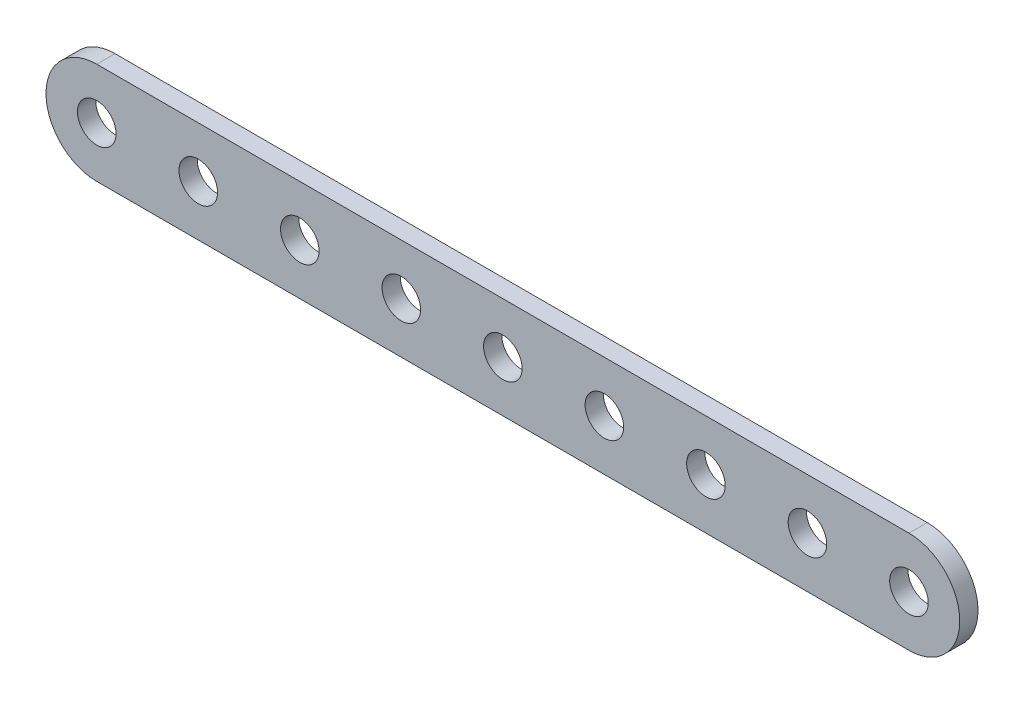
ISO-10303-21;
HEADER;
FILE_DESCRIPTION(('STEP AP214'),'2;1');
FILE_NAME('part.step','',(''),(''),'','','');
FILE_SCHEMA(('AUTOMOTIVE_DESIGN { 1 0 10303 214 1 1 1 1 }'));
ENDSEC;
DATA;
#1=APPLICATION_CONTEXT('core data for automotive mechanical design processes');
#2=APPLICATION_PROTOCOL_DEFINITION('international standard','automotive_design',2000,#1);
#3=PRODUCT_CONTEXT('',#1,'mechanical');
#4=PRODUCT('Part','Part','',(#3));
#5=PRODUCT_RELATED_PRODUCT_CATEGORY('part','',(#4));
#6=PRODUCT_DEFINITION_FORMATION('','',#4);
#7=PRODUCT_DEFINITION_CONTEXT('part definition',#1,'design');
#8=PRODUCT_DEFINITION('design','',#6,#7);
#9=PRODUCT_DEFINITION_SHAPE('','',#8);
#10=(LENGTH_UNIT() NAMED_UNIT(*) SI_UNIT(.MILLI.,.METRE.));
#11=(NAMED_UNIT(*) PLANE_ANGLE_UNIT() SI_UNIT($,.RADIAN.));
#12=(NAMED_UNIT(*) SI_UNIT($,.STERADIAN.) SOLID_ANGLE_UNIT());
#13=UNCERTAINTY_MEASURE_WITH_UNIT(LENGTH_MEASURE(1.E-05),#10,'distance_accuracy_value','');
#14=(GEOMETRIC_REPRESENTATION_CONTEXT(3) GLOBAL_UNCERTAINTY_ASSIGNED_CONTEXT((#13)) GLOBAL_UNIT_ASSIGNED_CONTEXT((#10,
#11,#12)) REPRESENTATION_CONTEXT('',''));
#15=CARTESIAN_POINT('',(0.,0.,0.));
#16=DIRECTION('',(0.,0.,1.));
#17=DIRECTION('',(1.,0.,0.));
#18=AXIS2_PLACEMENT_3D('',#15,#16,#17);
#19=CARTESIAN_POINT('',(-50.8,0.,2.286));
#20=DIRECTION('',(0.,0.,-1.));
#21=DIRECTION('',(-1.,0.,0.));
#22=AXIS2_PLACEMENT_3D('',#19,#20,#21);
#23=CYLINDRICAL_SURFACE('',#22,6.35000000000002);
#24=CARTESIAN_POINT('',(-50.8,0.,0.));
#25=DIRECTION('',(0.,0.,1.));
#26=DIRECTION('',(1.,0.,0.));
#27=AXIS2_PLACEMENT_3D('',#24,#25,#26);
#28=CIRCLE('',#27,6.35000000000002);
#29=CARTESIAN_POINT('',(-50.8,6.35000000000002,0.));
#30=VERTEX_POINT('',#29);
#31=CARTESIAN_POINT('',(-50.8,-6.35000000000002,0.));
#32=VERTEX_POINT('',#31);
#33=EDGE_CURVE('E100',#30,#32,#28,.T.);
#34=ORIENTED_EDGE('',*,*,#33,.T.);
#35=DIRECTION('',(0.,0.,-1.));
#36=VECTOR('',#35,1.);
#37=CARTESIAN_POINT('',(-50.8,-6.35000000000002,2.286));
#38=LINE('',#37,#36);
#39=CARTESIAN_POINT('',(-50.8,-6.35000000000002,2.286));
#40=VERTEX_POINT('',#39);
#41=EDGE_CURVE('E11',#40,#32,#38,.T.);
#42=ORIENTED_EDGE('',*,*,#41,.F.);
#43=CARTESIAN_POINT('',(-50.8,0.,2.286));
#44=DIRECTION('',(0.,0.,1.));
#45=DIRECTION('',(1.,0.,0.));
#46=AXIS2_PLACEMENT_3D('',#43,#44,#45);
#47=CIRCLE('',#46,6.35000000000002);
#48=CARTESIAN_POINT('',(-50.8,6.35000000000002,2.286));
#49=VERTEX_POINT('',#48);
#50=EDGE_CURVE('E88',#49,#40,#47,.T.);
#51=ORIENTED_EDGE('',*,*,#50,.F.);
#52=DIRECTION('',(0.,0.,-1.));
#53=VECTOR('',#52,1.);
#54=CARTESIAN_POINT('',(-50.8,6.35000000000002,2.286));
#55=LINE('',#54,#53);
#56=EDGE_CURVE('E96',#49,#30,#55,.T.);
#57=ORIENTED_EDGE('',*,*,#56,.T.);
#58=EDGE_LOOP('',(#34,#42,#51,#57));
#59=FACE_BOUND('',#58,.T.);
#60=ADVANCED_FACE('F37',(#59),#23,.T.);
#61=CARTESIAN_POINT('',(-50.8,-6.35000000000002,2.286));
#62=DIRECTION('',(0.,1.,0.));
#63=DIRECTION('',(-1.,0.,0.));
#64=AXIS2_PLACEMENT_3D('',#61,#62,#63);
#65=PLANE('',#64);
#66=DIRECTION('',(1.,0.,0.));
#67=VECTOR('',#66,1.);
#68=CARTESIAN_POINT('',(-50.8,-6.35000000000002,0.));
#69=LINE('',#68,#67);
#70=CARTESIAN_POINT('',(50.8,-6.35000000000002,0.));
#71=VERTEX_POINT('',#70);
#72=EDGE_CURVE('E92',#32,#71,#69,.T.);
#73=ORIENTED_EDGE('',*,*,#72,.T.);
#74=DIRECTION('',(0.,0.,-1.));
#75=VECTOR('',#74,1.);
#76=CARTESIAN_POINT('',(50.8,-6.35000000000002,2.286));
#77=LINE('',#76,#75);
#78=CARTESIAN_POINT('',(50.8,-6.35000000000002,2.286));
#79=VERTEX_POINT('',#78);
#80=EDGE_CURVE('E45',#79,#71,#77,.T.);
#81=ORIENTED_EDGE('',*,*,#80,.F.);
#82=DIRECTION('',(1.,0.,0.));
#83=VECTOR('',#82,1.);
#84=CARTESIAN_POINT('',(-50.8,-6.35000000000002,2.286));
#85=LINE('',#84,#83);
#86=EDGE_CURVE('E83',#40,#79,#85,.T.);
#87=ORIENTED_EDGE('',*,*,#86,.F.);
#88=ORIENTED_EDGE('',*,*,#41,.T.);
#89=EDGE_LOOP('',(#73,#81,#87,#88));
#90=FACE_BOUND('',#89,.T.);
#91=ADVANCED_FACE('F91',(#90),#65,.F.);
#92=CARTESIAN_POINT('',(50.8,0.,2.286));
#93=DIRECTION('',(0.,0.,-1.));
#94=DIRECTION('',(-1.,0.,0.));
#95=AXIS2_PLACEMENT_3D('',#92,#93,#94);
#96=CYLINDRICAL_SURFACE('',#95,6.35000000000002);
#97=CARTESIAN_POINT('',(50.8,0.,0.));
#98=DIRECTION('',(0.,0.,1.));
#99=DIRECTION('',(1.,0.,0.));
#100=AXIS2_PLACEMENT_3D('',#97,#98,#99);
#101=CIRCLE('',#100,6.35000000000002);
#102=CARTESIAN_POINT('',(50.8,6.35000000000004,0.));
#103=VERTEX_POINT('',#102);
#104=EDGE_CURVE('E70',#71,#103,#101,.T.);
#105=ORIENTED_EDGE('',*,*,#104,.T.);
#106=DIRECTION('',(0.,0.,-1.));
#107=VECTOR('',#106,1.);
#108=CARTESIAN_POINT('',(50.8,6.35000000000004,2.286));
#109=LINE('',#108,#107);
#110=CARTESIAN_POINT('',(50.8,6.35000000000004,2.286));
#111=VERTEX_POINT('',#110);
#112=EDGE_CURVE('E93',#111,#103,#109,.T.);
#113=ORIENTED_EDGE('',*,*,#112,.F.);
#114=CARTESIAN_POINT('',(50.8,0.,2.286));
#115=DIRECTION('',(0.,0.,1.));
#116=DIRECTION('',(1.,0.,0.));
#117=AXIS2_PLACEMENT_3D('',#114,#115,#116);
#118=CIRCLE('',#117,6.35000000000002);
#119=EDGE_CURVE('E86',#79,#111,#118,.T.);
#120=ORIENTED_EDGE('',*,*,#119,.F.);
#121=ORIENTED_EDGE('',*,*,#80,.T.);
#122=EDGE_LOOP('',(#105,#113,#120,#121));
#123=FACE_BOUND('',#122,.T.);
#124=ADVANCED_FACE('F94',(#123),#96,.T.);
#125=CARTESIAN_POINT('',(-50.8,6.35000000000002,2.286));
#126=DIRECTION('',(0.,-1.,0.));
#127=DIRECTION('',(1.,0.,0.));
#128=AXIS2_PLACEMENT_3D('',#125,#126,#127);
#129=PLANE('',#128);
#130=DIRECTION('',(-1.,0.,0.));
#131=VECTOR('',#130,1.);
#132=CARTESIAN_POINT('',(-50.8,6.35000000000002,0.));
#133=LINE('',#132,#131);
#134=EDGE_CURVE('E76',#103,#30,#133,.T.);
#135=ORIENTED_EDGE('',*,*,#134,.T.);
#136=ORIENTED_EDGE('',*,*,#56,.F.);
#137=DIRECTION('',(-1.,0.,0.));
#138=VECTOR('',#137,1.);
#139=CARTESIAN_POINT('',(-50.8,6.35000000000002,2.286));
#140=LINE('',#139,#138);
#141=EDGE_CURVE('E53',#111,#49,#140,.T.);
#142=ORIENTED_EDGE('',*,*,#141,.F.);
#143=ORIENTED_EDGE('',*,*,#112,.T.);
#144=EDGE_LOOP('',(#135,#136,#142,#143));
#145=FACE_BOUND('',#144,.T.);
#146=ADVANCED_FACE('F108',(#145),#129,.F.);
#147=CARTESIAN_POINT('',(-50.8,0.,2.286));
#148=DIRECTION('',(0.,0.,1.));
#149=DIRECTION('',(1.,0.,0.));
#150=AXIS2_PLACEMENT_3D('',#147,#148,#149);
#151=PLANE('',#150);
#152=CARTESIAN_POINT('',(-25.4,0.,2.286));
#153=DIRECTION('',(0.,0.,1.));
#154=DIRECTION('',(1.,0.,0.));
#155=AXIS2_PLACEMENT_3D('',#152,#153,#154);
#156=CIRCLE('',#155,2.413);
#157=CARTESIAN_POINT('',(-22.987,0.,2.286));
#158=VERTEX_POINT('',#157);
#159=EDGE_CURVE('E125',#158,#158,#156,.T.);
#160=ORIENTED_EDGE('',*,*,#159,.F.);
#161=EDGE_LOOP('',(#160));
#162=FACE_BOUND('',#161,.T.);
#163=CARTESIAN_POINT('',(-12.7,0.,2.286));
#164=DIRECTION('',(0.,0.,1.));
#165=DIRECTION('',(1.,0.,0.));
#166=AXIS2_PLACEMENT_3D('',#163,#164,#165);
#167=CIRCLE('',#166,2.413);
#168=CARTESIAN_POINT('',(-10.287,0.,2.286));
#169=VERTEX_POINT('',#168);
#170=EDGE_CURVE('E157',#169,#169,#167,.T.);
#171=ORIENTED_EDGE('',*,*,#170,.F.);
#172=EDGE_LOOP('',(#171));
#173=FACE_BOUND('',#172,.T.);
#174=CARTESIAN_POINT('',(0.,0.,2.286));
#175=DIRECTION('',(0.,0.,1.));
#176=DIRECTION('',(1.,0.,0.));
#177=AXIS2_PLACEMENT_3D('',#174,#175,#176);
#178=CIRCLE('',#177,2.413);
#179=CARTESIAN_POINT('',(2.41300000000001,0.,2.286));
#180=VERTEX_POINT('',#179);
#181=EDGE_CURVE('E151',#180,#180,#178,.T.);
#182=ORIENTED_EDGE('',*,*,#181,.F.);
#183=EDGE_LOOP('',(#182));
#184=FACE_BOUND('',#183,.T.);
#185=CARTESIAN_POINT('',(12.7,0.,2.286));
#186=DIRECTION('',(0.,0.,1.));
#187=DIRECTION('',(1.,0.,0.));
#188=AXIS2_PLACEMENT_3D('',#185,#186,#187);
#189=CIRCLE('',#188,2.413);
#190=CARTESIAN_POINT('',(15.113,0.,2.286));
#191=VERTEX_POINT('',#190);
#192=EDGE_CURVE('E145',#191,#191,#189,.T.);
#193=ORIENTED_EDGE('',*,*,#192,.F.);
#194=EDGE_LOOP('',(#193));
#195=FACE_BOUND('',#194,.T.);
#196=CARTESIAN_POINT('',(25.4,0.,2.286));
#197=DIRECTION('',(0.,0.,1.));
#198=DIRECTION('',(1.,0.,0.));
#199=AXIS2_PLACEMENT_3D('',#196,#197,#198);
#200=CIRCLE('',#199,2.413);
#201=CARTESIAN_POINT('',(27.813,0.,2.286));
#202=VERTEX_POINT('',#201);
#203=EDGE_CURVE('E139',#202,#202,#200,.T.);
#204=ORIENTED_EDGE('',*,*,#203,.F.);
#205=EDGE_LOOP('',(#204));
#206=FACE_BOUND('',#205,.T.);
#207=CARTESIAN_POINT('',(38.1,0.,2.286));
#208=DIRECTION('',(0.,0.,1.));
#209=DIRECTION('',(1.,0.,0.));
#210=AXIS2_PLACEMENT_3D('',#207,#208,#209);
#211=CIRCLE('',#210,2.413);
#212=CARTESIAN_POINT('',(40.513,0.,2.286));
#213=VERTEX_POINT('',#212);
#214=EDGE_CURVE('E133',#213,#213,#211,.T.);
#215=ORIENTED_EDGE('',*,*,#214,.F.);
#216=EDGE_LOOP('',(#215));
#217=FACE_BOUND('',#216,.T.);
#218=CARTESIAN_POINT('',(50.8,0.,2.286));
#219=DIRECTION('',(0.,0.,1.));
#220=DIRECTION('',(1.,0.,0.));
#221=AXIS2_PLACEMENT_3D('',#218,#219,#220);
#222=CIRCLE('',#221,2.413);
#223=CARTESIAN_POINT('',(53.213,0.,2.286));
#224=VERTEX_POINT('',#223);
#225=EDGE_CURVE('E126',#224,#224,#222,.T.);
#226=ORIENTED_EDGE('',*,*,#225,.F.);
#227=EDGE_LOOP('',(#226));
#228=FACE_BOUND('',#227,.T.);
#229=CARTESIAN_POINT('',(-38.1,0.,2.286));
#230=DIRECTION('',(0.,0.,1.));
#231=DIRECTION('',(1.,0.,0.));
#232=AXIS2_PLACEMENT_3D('',#229,#230,#231);
#233=CIRCLE('',#232,2.413);
#234=CARTESIAN_POINT('',(-35.687,0.,2.286));
#235=VERTEX_POINT('',#234);
#236=EDGE_CURVE('E117',#235,#235,#233,.T.);
#237=ORIENTED_EDGE('',*,*,#236,.F.);
#238=EDGE_LOOP('',(#237));
#239=FACE_BOUND('',#238,.T.);
#240=CARTESIAN_POINT('',(-50.8,0.,2.286));
#241=DIRECTION('',(0.,0.,1.));
#242=DIRECTION('',(1.,0.,0.));
#243=AXIS2_PLACEMENT_3D('',#240,#241,#242);
#244=CIRCLE('',#243,2.413);
#245=CARTESIAN_POINT('',(-48.387,0.,2.286));
#246=VERTEX_POINT('',#245);
#247=EDGE_CURVE('E114',#246,#246,#244,.T.);
#248=ORIENTED_EDGE('',*,*,#247,.F.);
#249=EDGE_LOOP('',(#248));
#250=FACE_BOUND('',#249,.T.);
#251=ORIENTED_EDGE('',*,*,#50,.T.);
#252=ORIENTED_EDGE('',*,*,#86,.T.);
#253=ORIENTED_EDGE('',*,*,#119,.T.);
#254=ORIENTED_EDGE('',*,*,#141,.T.);
#255=EDGE_LOOP('',(#251,#252,#253,#254));
#256=FACE_BOUND('',#255,.T.);
#257=ADVANCED_FACE('F84',(#162,#173,#184,#195,#206,#217,#228,#239,#250,#256),#151,.T.);
#258=CARTESIAN_POINT('',(-50.8,0.,0.));
#259=DIRECTION('',(0.,0.,1.));
#260=DIRECTION('',(1.,0.,0.));
#261=AXIS2_PLACEMENT_3D('',#258,#259,#260);
#262=PLANE('',#261);
#263=CARTESIAN_POINT('',(-25.4,0.,0.));
#264=DIRECTION('',(0.,0.,1.));
#265=DIRECTION('',(1.,0.,0.));
#266=AXIS2_PLACEMENT_3D('',#263,#264,#265);
#267=CIRCLE('',#266,2.413);
#268=CARTESIAN_POINT('',(-22.987,0.,0.));
#269=VERTEX_POINT('',#268);
#270=EDGE_CURVE('E160',#269,#269,#267,.T.);
#271=ORIENTED_EDGE('',*,*,#270,.T.);
#272=EDGE_LOOP('',(#271));
#273=FACE_BOUND('',#272,.T.);
#274=CARTESIAN_POINT('',(-12.7,0.,0.));
#275=DIRECTION('',(0.,0.,1.));
#276=DIRECTION('',(1.,0.,0.));
#277=AXIS2_PLACEMENT_3D('',#274,#275,#276);
#278=CIRCLE('',#277,2.413);
#279=CARTESIAN_POINT('',(-10.287,0.,0.));
#280=VERTEX_POINT('',#279);
#281=EDGE_CURVE('E154',#280,#280,#278,.T.);
#282=ORIENTED_EDGE('',*,*,#281,.T.);
#283=EDGE_LOOP('',(#282));
#284=FACE_BOUND('',#283,.T.);
#285=CARTESIAN_POINT('',(0.,0.,0.));
#286=DIRECTION('',(0.,0.,1.));
#287=DIRECTION('',(1.,0.,0.));
#288=AXIS2_PLACEMENT_3D('',#285,#286,#287);
#289=CIRCLE('',#288,2.413);
#290=CARTESIAN_POINT('',(2.41300000000001,0.,0.));
#291=VERTEX_POINT('',#290);
#292=EDGE_CURVE('E148',#291,#291,#289,.T.);
#293=ORIENTED_EDGE('',*,*,#292,.T.);
#294=EDGE_LOOP('',(#293));
#295=FACE_BOUND('',#294,.T.);
#296=CARTESIAN_POINT('',(12.7,0.,0.));
#297=DIRECTION('',(0.,0.,1.));
#298=DIRECTION('',(1.,0.,0.));
#299=AXIS2_PLACEMENT_3D('',#296,#297,#298);
#300=CIRCLE('',#299,2.413);
#301=CARTESIAN_POINT('',(15.113,0.,0.));
#302=VERTEX_POINT('',#301);
#303=EDGE_CURVE('E142',#302,#302,#300,.T.);
#304=ORIENTED_EDGE('',*,*,#303,.T.);
#305=EDGE_LOOP('',(#304));
#306=FACE_BOUND('',#305,.T.);
#307=CARTESIAN_POINT('',(25.4,0.,0.));
#308=DIRECTION('',(0.,0.,1.));
#309=DIRECTION('',(1.,0.,0.));
#310=AXIS2_PLACEMENT_3D('',#307,#308,#309);
#311=CIRCLE('',#310,2.413);
#312=CARTESIAN_POINT('',(27.813,0.,0.));
#313=VERTEX_POINT('',#312);
#314=EDGE_CURVE('E136',#313,#313,#311,.T.);
#315=ORIENTED_EDGE('',*,*,#314,.T.);
#316=EDGE_LOOP('',(#315));
#317=FACE_BOUND('',#316,.T.);
#318=CARTESIAN_POINT('',(38.1,0.,0.));
#319=DIRECTION('',(0.,0.,1.));
#320=DIRECTION('',(1.,0.,0.));
#321=AXIS2_PLACEMENT_3D('',#318,#319,#320);
#322=CIRCLE('',#321,2.413);
#323=CARTESIAN_POINT('',(40.513,0.,0.));
#324=VERTEX_POINT('',#323);
#325=EDGE_CURVE('E129',#324,#324,#322,.T.);
#326=ORIENTED_EDGE('',*,*,#325,.T.);
#327=EDGE_LOOP('',(#326));
#328=FACE_BOUND('',#327,.T.);
#329=CARTESIAN_POINT('',(50.8,0.,0.));
#330=DIRECTION('',(0.,0.,1.));
#331=DIRECTION('',(1.,0.,0.));
#332=AXIS2_PLACEMENT_3D('',#329,#330,#331);
#333=CIRCLE('',#332,2.413);
#334=CARTESIAN_POINT('',(53.213,0.,0.));
#335=VERTEX_POINT('',#334);
#336=EDGE_CURVE('E130',#335,#335,#333,.T.);
#337=ORIENTED_EDGE('',*,*,#336,.T.);
#338=EDGE_LOOP('',(#337));
#339=FACE_BOUND('',#338,.T.);
#340=CARTESIAN_POINT('',(-38.1,0.,0.));
#341=DIRECTION('',(0.,0.,1.));
#342=DIRECTION('',(1.,0.,0.));
#343=AXIS2_PLACEMENT_3D('',#340,#341,#342);
#344=CIRCLE('',#343,2.413);
#345=CARTESIAN_POINT('',(-35.687,0.,0.));
#346=VERTEX_POINT('',#345);
#347=EDGE_CURVE('E122',#346,#346,#344,.T.);
#348=ORIENTED_EDGE('',*,*,#347,.T.);
#349=EDGE_LOOP('',(#348));
#350=FACE_BOUND('',#349,.T.);
#351=CARTESIAN_POINT('',(-50.8,0.,0.));
#352=DIRECTION('',(0.,0.,1.));
#353=DIRECTION('',(1.,0.,0.));
#354=AXIS2_PLACEMENT_3D('',#351,#352,#353);
#355=CIRCLE('',#354,2.413);
#356=CARTESIAN_POINT('',(-48.387,0.,0.));
#357=VERTEX_POINT('',#356);
#358=EDGE_CURVE('E103',#357,#357,#355,.T.);
#359=ORIENTED_EDGE('',*,*,#358,.T.);
#360=EDGE_LOOP('',(#359));
#361=FACE_BOUND('',#360,.T.);
#362=ORIENTED_EDGE('',*,*,#33,.F.);
#363=ORIENTED_EDGE('',*,*,#134,.F.);
#364=ORIENTED_EDGE('',*,*,#104,.F.);
#365=ORIENTED_EDGE('',*,*,#72,.F.);
#366=EDGE_LOOP('',(#362,#363,#364,#365));
#367=FACE_BOUND('',#366,.T.);
#368=ADVANCED_FACE('F111',(#273,#284,#295,#306,#317,#328,#339,#350,#361,#367),#262,.F.);
#369=CARTESIAN_POINT('',(-50.8,0.,0.));
#370=DIRECTION('',(0.,0.,1.));
#371=DIRECTION('',(1.,0.,0.));
#372=AXIS2_PLACEMENT_3D('',#369,#370,#371);
#373=CYLINDRICAL_SURFACE('',#372,2.413);
#374=ORIENTED_EDGE('',*,*,#358,.F.);
#375=EDGE_LOOP('',(#374));
#376=FACE_BOUND('',#375,.T.);
#377=ORIENTED_EDGE('',*,*,#247,.T.);
#378=EDGE_LOOP('',(#377));
#379=FACE_BOUND('',#378,.T.);
#380=ADVANCED_FACE('F196',(#376,#379),#373,.F.);
#381=CARTESIAN_POINT('',(-38.1,0.,0.));
#382=DIRECTION('',(0.,0.,1.));
#383=DIRECTION('',(1.,0.,0.));
#384=AXIS2_PLACEMENT_3D('',#381,#382,#383);
#385=CYLINDRICAL_SURFACE('',#384,2.413);
#386=ORIENTED_EDGE('',*,*,#347,.F.);
#387=EDGE_LOOP('',(#386));
#388=FACE_BOUND('',#387,.T.);
#389=ORIENTED_EDGE('',*,*,#236,.T.);
#390=EDGE_LOOP('',(#389));
#391=FACE_BOUND('',#390,.T.);
#392=ADVANCED_FACE('F198',(#388,#391),#385,.F.);
#393=CARTESIAN_POINT('',(50.8,0.,0.));
#394=DIRECTION('',(0.,0.,1.));
#395=DIRECTION('',(1.,0.,0.));
#396=AXIS2_PLACEMENT_3D('',#393,#394,#395);
#397=CYLINDRICAL_SURFACE('',#396,2.413);
#398=ORIENTED_EDGE('',*,*,#336,.F.);
#399=EDGE_LOOP('',(#398));
#400=FACE_BOUND('',#399,.T.);
#401=ORIENTED_EDGE('',*,*,#225,.T.);
#402=EDGE_LOOP('',(#401));
#403=FACE_BOUND('',#402,.T.);
#404=ADVANCED_FACE('F205',(#400,#403),#397,.F.);
#405=CARTESIAN_POINT('',(38.1,0.,0.));
#406=DIRECTION('',(0.,0.,1.));
#407=DIRECTION('',(1.,0.,0.));
#408=AXIS2_PLACEMENT_3D('',#405,#406,#407);
#409=CYLINDRICAL_SURFACE('',#408,2.413);
#410=ORIENTED_EDGE('',*,*,#325,.F.);
#411=EDGE_LOOP('',(#410));
#412=FACE_BOUND('',#411,.T.);
#413=ORIENTED_EDGE('',*,*,#214,.T.);
#414=EDGE_LOOP('',(#413));
#415=FACE_BOUND('',#414,.T.);
#416=ADVANCED_FACE('F248',(#412,#415),#409,.F.);
#417=CARTESIAN_POINT('',(25.4,0.,0.));
#418=DIRECTION('',(0.,0.,1.));
#419=DIRECTION('',(1.,0.,0.));
#420=AXIS2_PLACEMENT_3D('',#417,#418,#419);
#421=CYLINDRICAL_SURFACE('',#420,2.413);
#422=ORIENTED_EDGE('',*,*,#314,.F.);
#423=EDGE_LOOP('',(#422));
#424=FACE_BOUND('',#423,.T.);
#425=ORIENTED_EDGE('',*,*,#203,.T.);
#426=EDGE_LOOP('',(#425));
#427=FACE_BOUND('',#426,.T.);
#428=ADVANCED_FACE('F258',(#424,#427),#421,.F.);
#429=CARTESIAN_POINT('',(12.7,0.,0.));
#430=DIRECTION('',(0.,0.,1.));
#431=DIRECTION('',(1.,0.,0.));
#432=AXIS2_PLACEMENT_3D('',#429,#430,#431);
#433=CYLINDRICAL_SURFACE('',#432,2.413);
#434=ORIENTED_EDGE('',*,*,#303,.F.);
#435=EDGE_LOOP('',(#434));
#436=FACE_BOUND('',#435,.T.);
#437=ORIENTED_EDGE('',*,*,#192,.T.);
#438=EDGE_LOOP('',(#437));
#439=FACE_BOUND('',#438,.T.);
#440=ADVANCED_FACE('F268',(#436,#439),#433,.F.);
#441=CARTESIAN_POINT('',(0.,0.,0.));
#442=DIRECTION('',(0.,0.,1.));
#443=DIRECTION('',(1.,0.,0.));
#444=AXIS2_PLACEMENT_3D('',#441,#442,#443);
#445=CYLINDRICAL_SURFACE('',#444,2.413);
#446=ORIENTED_EDGE('',*,*,#292,.F.);
#447=EDGE_LOOP('',(#446));
#448=FACE_BOUND('',#447,.T.);
#449=ORIENTED_EDGE('',*,*,#181,.T.);
#450=EDGE_LOOP('',(#449));
#451=FACE_BOUND('',#450,.T.);
#452=ADVANCED_FACE('F278',(#448,#451),#445,.F.);
#453=CARTESIAN_POINT('',(-12.7,0.,0.));
#454=DIRECTION('',(0.,0.,1.));
#455=DIRECTION('',(1.,0.,0.));
#456=AXIS2_PLACEMENT_3D('',#453,#454,#455);
#457=CYLINDRICAL_SURFACE('',#456,2.413);
#458=ORIENTED_EDGE('',*,*,#281,.F.);
#459=EDGE_LOOP('',(#458));
#460=FACE_BOUND('',#459,.T.);
#461=ORIENTED_EDGE('',*,*,#170,.T.);
#462=EDGE_LOOP('',(#461));
#463=FACE_BOUND('',#462,.T.);
#464=ADVANCED_FACE('F173',(#460,#463),#457,.F.);
#465=CARTESIAN_POINT('',(-25.4,0.,0.));
#466=DIRECTION('',(0.,0.,1.));
#467=DIRECTION('',(1.,0.,0.));
#468=AXIS2_PLACEMENT_3D('',#465,#466,#467);
#469=CYLINDRICAL_SURFACE('',#468,2.413);
#470=ORIENTED_EDGE('',*,*,#270,.F.);
#471=EDGE_LOOP('',(#470));
#472=FACE_BOUND('',#471,.T.);
#473=ORIENTED_EDGE('',*,*,#159,.T.);
#474=EDGE_LOOP('',(#473));
#475=FACE_BOUND('',#474,.T.);
#476=ADVANCED_FACE('F170',(#472,#475),#469,.F.);
#477=CLOSED_SHELL('',(#60,#91,#124,#146,#257,#368,#380,#392,#404,#416,#428,#440,#452,#464,#476));
#478=MANIFOLD_SOLID_BREP('B2',#477);
#479=ADVANCED_BREP_SHAPE_REPRESENTATION('',(#18,#478),#14);
#480=SHAPE_DEFINITION_REPRESENTATION(#9,#479);
ENDSEC;
END-ISO-10303-21;
